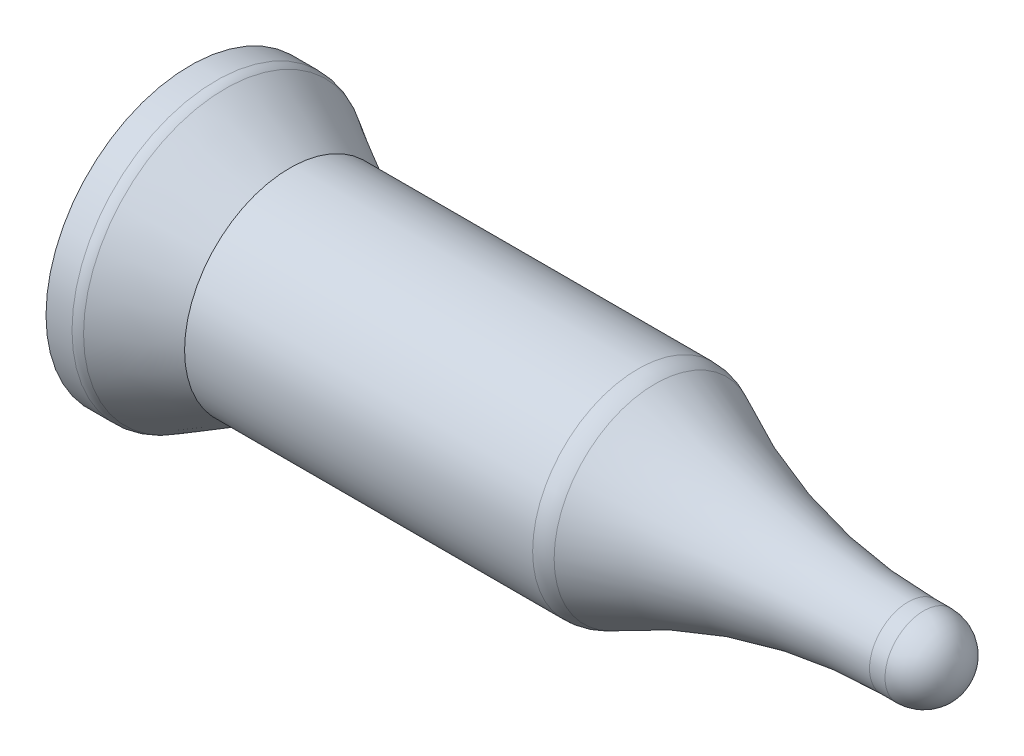
ISO-10303-21;
HEADER;
FILE_DESCRIPTION(('STEP AP214'),'2;1');
FILE_NAME('part.step','',(''),(''),'','','');
FILE_SCHEMA(('AUTOMOTIVE_DESIGN { 1 0 10303 214 1 1 1 1 }'));
ENDSEC;
DATA;
#1=APPLICATION_CONTEXT('core data for automotive mechanical design processes');
#2=APPLICATION_PROTOCOL_DEFINITION('international standard','automotive_design',2000,#1);
#3=PRODUCT_CONTEXT('',#1,'mechanical');
#4=PRODUCT('Part','Part','',(#3));
#5=PRODUCT_RELATED_PRODUCT_CATEGORY('part','',(#4));
#6=PRODUCT_DEFINITION_FORMATION('','',#4);
#7=PRODUCT_DEFINITION_CONTEXT('part definition',#1,'design');
#8=PRODUCT_DEFINITION('design','',#6,#7);
#9=PRODUCT_DEFINITION_SHAPE('','',#8);
#10=(LENGTH_UNIT() NAMED_UNIT(*) SI_UNIT(.MILLI.,.METRE.));
#11=(NAMED_UNIT(*) PLANE_ANGLE_UNIT() SI_UNIT($,.RADIAN.));
#12=(NAMED_UNIT(*) SI_UNIT($,.STERADIAN.) SOLID_ANGLE_UNIT());
#13=UNCERTAINTY_MEASURE_WITH_UNIT(LENGTH_MEASURE(1.E-05),#10,'distance_accuracy_value','');
#14=(GEOMETRIC_REPRESENTATION_CONTEXT(3) GLOBAL_UNCERTAINTY_ASSIGNED_CONTEXT((#13)) GLOBAL_UNIT_ASSIGNED_CONTEXT((#10,
#11,#12)) REPRESENTATION_CONTEXT('',''));
#15=CARTESIAN_POINT('',(0.,0.,0.));
#16=DIRECTION('',(0.,0.,1.));
#17=DIRECTION('',(1.,0.,0.));
#18=AXIS2_PLACEMENT_3D('',#15,#16,#17);
#19=CARTESIAN_POINT('',(31.6588044914918,0.,0.));
#20=DIRECTION('',(-1.,0.,0.));
#21=DIRECTION('',(0.,-1.,0.));
#22=AXIS2_PLACEMENT_3D('',#19,#20,#21);
#23=SPHERICAL_SURFACE('',#22,1.58750000000001);
#24=CARTESIAN_POINT('',(31.6588044914918,0.,0.));
#25=DIRECTION('',(-1.,0.,0.));
#26=DIRECTION('',(0.,0.,1.));
#27=AXIS2_PLACEMENT_3D('',#24,#25,#26);
#28=CIRCLE('',#27,1.58750000000005);
#29=CARTESIAN_POINT('',(31.6588044914918,0.,1.58750000000005));
#30=VERTEX_POINT('',#29);
#31=EDGE_CURVE('E10',#30,#30,#28,.T.);
#32=ORIENTED_EDGE('',*,*,#31,.F.);
#33=EDGE_LOOP('',(#32));
#34=FACE_BOUND('',#33,.T.);
#35=ADVANCED_FACE('F27',(#34),#23,.T.);
#36=CARTESIAN_POINT('',(0.,0.,0.));
#37=DIRECTION('',(-1.,0.,0.));
#38=DIRECTION('',(0.,0.,1.));
#39=AXIS2_PLACEMENT_3D('',#36,#37,#38);
#40=CYLINDRICAL_SURFACE('',#39,1.58750000000005);
#41=CARTESIAN_POINT('',(31.021091308276,0.,0.));
#42=DIRECTION('',(-1.,0.,0.));
#43=DIRECTION('',(0.,0.,1.));
#44=AXIS2_PLACEMENT_3D('',#41,#42,#43);
#45=CIRCLE('',#44,1.58750000000005);
#46=CARTESIAN_POINT('',(31.021091308276,0.,1.58750000000005));
#47=VERTEX_POINT('',#46);
#48=EDGE_CURVE('E33',#47,#47,#45,.T.);
#49=ORIENTED_EDGE('',*,*,#48,.F.);
#50=EDGE_LOOP('',(#49));
#51=FACE_BOUND('',#50,.T.);
#52=ORIENTED_EDGE('',*,*,#31,.T.);
#53=EDGE_LOOP('',(#52));
#54=FACE_BOUND('',#53,.T.);
#55=ADVANCED_FACE('F75',(#51,#54),#40,.T.);
#56=CARTESIAN_POINT('',(31.021091308276,0.,0.));
#57=DIRECTION('',(-1.,0.,0.));
#58=DIRECTION('',(0.,0.,1.));
#59=AXIS2_PLACEMENT_3D('',#56,#57,#58);
#60=TOROIDAL_SURFACE('',#59,23.9395000000004,22.3520000000004);
#61=ORIENTED_EDGE('',*,*,#48,.T.);
#62=EDGE_LOOP('',(#61));
#63=FACE_BOUND('',#62,.T.);
#64=CARTESIAN_POINT('',(20.6187219158344,0.,0.));
#65=DIRECTION('',(-1.,0.,0.));
#66=DIRECTION('',(0.,0.,1.));
#67=AXIS2_PLACEMENT_3D('',#64,#65,#66);
#68=CIRCLE('',#67,4.15560212765963);
#69=CARTESIAN_POINT('',(20.6187219158344,0.,4.15560212765963));
#70=VERTEX_POINT('',#69);
#71=EDGE_CURVE('E37',#70,#70,#68,.T.);
#72=ORIENTED_EDGE('',*,*,#71,.F.);
#73=EDGE_LOOP('',(#72));
#74=FACE_BOUND('',#73,.T.);
#75=ADVANCED_FACE('F80',(#63,#74),#60,.F.);
#76=CARTESIAN_POINT('',(19.9094694572588,0.,0.));
#77=DIRECTION('',(-1.,0.,0.));
#78=DIRECTION('',(0.,0.,1.));
#79=AXIS2_PLACEMENT_3D('',#76,#77,#78);
#80=TOROIDAL_SURFACE('',#79,2.80670000000005,1.52399999999998);
#81=CARTESIAN_POINT('',(19.9094694572588,0.,0.));
#82=DIRECTION('',(-1.,0.,0.));
#83=DIRECTION('',(0.,0.,1.));
#84=AXIS2_PLACEMENT_3D('',#81,#82,#83);
#85=CIRCLE('',#84,4.33070000000002);
#86=CARTESIAN_POINT('',(19.9094694572588,0.,4.33070000000002));
#87=VERTEX_POINT('',#86);
#88=EDGE_CURVE('E41',#87,#87,#85,.T.);
#89=ORIENTED_EDGE('',*,*,#88,.F.);
#90=EDGE_LOOP('',(#89));
#91=FACE_BOUND('',#90,.T.);
#92=ORIENTED_EDGE('',*,*,#71,.T.);
#93=EDGE_LOOP('',(#92));
#94=FACE_BOUND('',#93,.T.);
#95=ADVANCED_FACE('F85',(#91,#94),#80,.T.);
#96=CARTESIAN_POINT('',(0.,0.,0.));
#97=DIRECTION('',(-1.,0.,0.));
#98=DIRECTION('',(0.,0.,1.));
#99=AXIS2_PLACEMENT_3D('',#96,#97,#98);
#100=CYLINDRICAL_SURFACE('',#99,4.33070000000003);
#101=ORIENTED_EDGE('',*,*,#88,.T.);
#102=EDGE_LOOP('',(#101));
#103=FACE_BOUND('',#102,.T.);
#104=CARTESIAN_POINT('',(5.59464841628378,0.,0.));
#105=DIRECTION('',(-1.,0.,0.));
#106=DIRECTION('',(0.,0.,1.));
#107=AXIS2_PLACEMENT_3D('',#104,#105,#106);
#108=CIRCLE('',#107,4.33070000000004);
#109=CARTESIAN_POINT('',(5.59464841628378,0.,4.33070000000004));
#110=VERTEX_POINT('',#109);
#111=EDGE_CURVE('E46',#110,#110,#108,.T.);
#112=ORIENTED_EDGE('',*,*,#111,.F.);
#113=EDGE_LOOP('',(#112));
#114=FACE_BOUND('',#113,.T.);
#115=ADVANCED_FACE('F90',(#103,#114),#100,.T.);
#116=CARTESIAN_POINT('',(2.94091338662144,0.,0.));
#117=DIRECTION('',(-1.,0.,0.));
#118=DIRECTION('',(0.,0.,1.));
#119=AXIS2_PLACEMENT_3D('',#116,#117,#118);
#120=CONICAL_SURFACE('',#119,5.83211104030662,0.514872129338414);
#121=ORIENTED_EDGE('',*,*,#111,.T.);
#122=EDGE_LOOP('',(#121));
#123=FACE_BOUND('',#122,.T.);
#124=CARTESIAN_POINT('',(2.94091338662144,0.,0.));
#125=DIRECTION('',(-1.,0.,0.));
#126=DIRECTION('',(0.,0.,1.));
#127=AXIS2_PLACEMENT_3D('',#124,#125,#126);
#128=CIRCLE('',#127,5.83211104030662);
#129=CARTESIAN_POINT('',(2.94091338662144,0.,5.83211104030662));
#130=VERTEX_POINT('',#129);
#131=EDGE_CURVE('E49',#130,#130,#128,.T.);
#132=ORIENTED_EDGE('',*,*,#131,.F.);
#133=EDGE_LOOP('',(#132));
#134=FACE_BOUND('',#133,.T.);
#135=ADVANCED_FACE('F71',(#123,#134),#120,.T.);
#136=CARTESIAN_POINT('',(2.56568663382259,0.,0.));
#137=DIRECTION('',(-1.,0.,0.));
#138=DIRECTION('',(0.,0.,1.));
#139=AXIS2_PLACEMENT_3D('',#136,#137,#138);
#140=TOROIDAL_SURFACE('',#139,5.16890000000039,0.762000000000017);
#141=CARTESIAN_POINT('',(2.56568663382259,0.,0.));
#142=DIRECTION('',(-1.,0.,0.));
#143=DIRECTION('',(0.,0.,1.));
#144=AXIS2_PLACEMENT_3D('',#141,#142,#143);
#145=CIRCLE('',#144,5.9309000000004);
#146=CARTESIAN_POINT('',(2.56568663382259,0.,5.9309000000004));
#147=VERTEX_POINT('',#146);
#148=EDGE_CURVE('E52',#147,#147,#145,.T.);
#149=ORIENTED_EDGE('',*,*,#148,.F.);
#150=EDGE_LOOP('',(#149));
#151=FACE_BOUND('',#150,.T.);
#152=ORIENTED_EDGE('',*,*,#131,.T.);
#153=EDGE_LOOP('',(#152));
#154=FACE_BOUND('',#153,.T.);
#155=ADVANCED_FACE('F63',(#151,#154),#140,.T.);
#156=CARTESIAN_POINT('',(0.,0.,0.));
#157=DIRECTION('',(-1.,0.,0.));
#158=DIRECTION('',(0.,0.,1.));
#159=AXIS2_PLACEMENT_3D('',#156,#157,#158);
#160=CYLINDRICAL_SURFACE('',#159,5.9309000000004);
#161=ORIENTED_EDGE('',*,*,#148,.T.);
#162=EDGE_LOOP('',(#161));
#163=FACE_BOUND('',#162,.T.);
#164=CARTESIAN_POINT('',(1.49630449149185,0.,0.));
#165=DIRECTION('',(-1.,0.,0.));
#166=DIRECTION('',(0.,0.,1.));
#167=AXIS2_PLACEMENT_3D('',#164,#165,#166);
#168=CIRCLE('',#167,5.9309000000004);
#169=CARTESIAN_POINT('',(1.49630449149185,0.,5.9309000000004));
#170=VERTEX_POINT('',#169);
#171=EDGE_CURVE('E55',#170,#170,#168,.T.);
#172=ORIENTED_EDGE('',*,*,#171,.F.);
#173=EDGE_LOOP('',(#172));
#174=FACE_BOUND('',#173,.T.);
#175=ADVANCED_FACE('F61',(#163,#174),#160,.T.);
#176=CARTESIAN_POINT('',(1.49630449149185,-27.6838619794307,0.));
#177=DIRECTION('',(1.,0.,0.));
#178=DIRECTION('',(0.,0.,-1.));
#179=AXIS2_PLACEMENT_3D('',#176,#177,#178);
#180=PLANE('',#179);
#181=ORIENTED_EDGE('',*,*,#171,.T.);
#182=EDGE_LOOP('',(#181));
#183=FACE_BOUND('',#182,.T.);
#184=ADVANCED_FACE('F59',(#183),#180,.F.);
#185=CLOSED_SHELL('',(#35,#55,#75,#95,#115,#135,#155,#175,#184));
#186=MANIFOLD_SOLID_BREP('B2',#185);
#187=ADVANCED_BREP_SHAPE_REPRESENTATION('',(#18,#186),#14);
#188=SHAPE_DEFINITION_REPRESENTATION(#9,#187);
ENDSEC;
END-ISO-10303-21;
